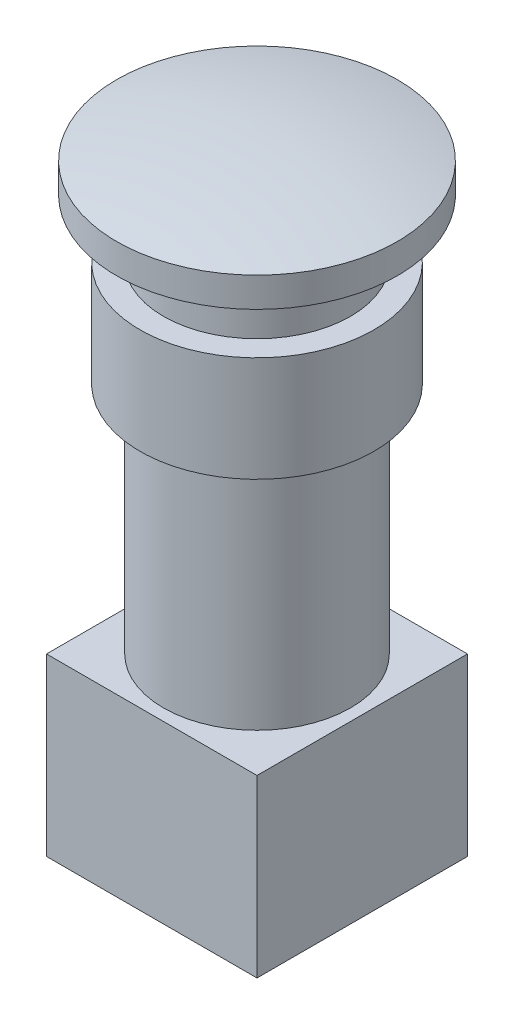
ISO-10303-21;
HEADER;
FILE_DESCRIPTION(('STEP AP214'),'2;1');
FILE_NAME('part.step','',(''),(''),'','','');
FILE_SCHEMA(('AUTOMOTIVE_DESIGN { 1 0 10303 214 1 1 1 1 }'));
ENDSEC;
DATA;
#1=APPLICATION_CONTEXT('core data for automotive mechanical design processes');
#2=APPLICATION_PROTOCOL_DEFINITION('international standard','automotive_design',2000,#1);
#3=PRODUCT_CONTEXT('',#1,'mechanical');
#4=PRODUCT('Part','Part','',(#3));
#5=PRODUCT_RELATED_PRODUCT_CATEGORY('part','',(#4));
#6=PRODUCT_DEFINITION_FORMATION('','',#4);
#7=PRODUCT_DEFINITION_CONTEXT('part definition',#1,'design');
#8=PRODUCT_DEFINITION('design','',#6,#7);
#9=PRODUCT_DEFINITION_SHAPE('','',#8);
#10=(LENGTH_UNIT() NAMED_UNIT(*) SI_UNIT(.MILLI.,.METRE.));
#11=(NAMED_UNIT(*) PLANE_ANGLE_UNIT() SI_UNIT($,.RADIAN.));
#12=(NAMED_UNIT(*) SI_UNIT($,.STERADIAN.) SOLID_ANGLE_UNIT());
#13=UNCERTAINTY_MEASURE_WITH_UNIT(LENGTH_MEASURE(1.E-05),#10,'distance_accuracy_value','');
#14=(GEOMETRIC_REPRESENTATION_CONTEXT(3) GLOBAL_UNCERTAINTY_ASSIGNED_CONTEXT((#13)) GLOBAL_UNIT_ASSIGNED_CONTEXT((#10,
#11,#12)) REPRESENTATION_CONTEXT('',''));
#15=CARTESIAN_POINT('',(0.,0.,0.));
#16=DIRECTION('',(0.,0.,1.));
#17=DIRECTION('',(1.,0.,0.));
#18=AXIS2_PLACEMENT_3D('',#15,#16,#17);
#19=CARTESIAN_POINT('',(0.,0.,0.));
#20=DIRECTION('',(0.,-1.,0.));
#21=DIRECTION('',(0.,0.,-1.));
#22=AXIS2_PLACEMENT_3D('',#19,#20,#21);
#23=CYLINDRICAL_SURFACE('',#22,8.);
#24=CARTESIAN_POINT('',(0.,0.,0.));
#25=DIRECTION('',(0.,-1.,0.));
#26=DIRECTION('',(0.,0.,-1.));
#27=AXIS2_PLACEMENT_3D('',#24,#25,#26);
#28=CIRCLE('',#27,8.);
#29=CARTESIAN_POINT('',(0.,0.,-8.));
#30=VERTEX_POINT('',#29);
#31=EDGE_CURVE('E11',#30,#30,#28,.T.);
#32=ORIENTED_EDGE('',*,*,#31,.F.);
#33=EDGE_LOOP('',(#32));
#34=FACE_BOUND('',#33,.T.);
#35=CARTESIAN_POINT('',(0.,20.,0.));
#36=DIRECTION('',(0.,-1.,0.));
#37=DIRECTION('',(0.,0.,-1.));
#38=AXIS2_PLACEMENT_3D('',#35,#36,#37);
#39=CIRCLE('',#38,8.);
#40=CARTESIAN_POINT('',(0.,20.,-8.));
#41=VERTEX_POINT('',#40);
#42=EDGE_CURVE('E44',#41,#41,#39,.T.);
#43=ORIENTED_EDGE('',*,*,#42,.T.);
#44=EDGE_LOOP('',(#43));
#45=FACE_BOUND('',#44,.T.);
#46=ADVANCED_FACE('F36',(#34,#45),#23,.T.);
#47=CARTESIAN_POINT('',(-10.,20.,0.));
#48=DIRECTION('',(0.,1.,0.));
#49=DIRECTION('',(0.,0.,1.));
#50=AXIS2_PLACEMENT_3D('',#47,#48,#49);
#51=PLANE('',#50);
#52=ORIENTED_EDGE('',*,*,#42,.F.);
#53=EDGE_LOOP('',(#52));
#54=FACE_BOUND('',#53,.T.);
#55=CARTESIAN_POINT('',(0.,20.,0.));
#56=DIRECTION('',(0.,-1.,0.));
#57=DIRECTION('',(0.,0.,-1.));
#58=AXIS2_PLACEMENT_3D('',#55,#56,#57);
#59=CIRCLE('',#58,10.);
#60=CARTESIAN_POINT('',(0.,20.,-10.));
#61=VERTEX_POINT('',#60);
#62=EDGE_CURVE('E127',#61,#61,#59,.T.);
#63=ORIENTED_EDGE('',*,*,#62,.T.);
#64=EDGE_LOOP('',(#63));
#65=FACE_BOUND('',#64,.T.);
#66=ADVANCED_FACE('F133',(#54,#65),#51,.F.);
#67=CARTESIAN_POINT('',(0.,0.,0.));
#68=DIRECTION('',(0.,-1.,0.));
#69=DIRECTION('',(0.,0.,-1.));
#70=AXIS2_PLACEMENT_3D('',#67,#68,#69);
#71=CYLINDRICAL_SURFACE('',#70,10.);
#72=ORIENTED_EDGE('',*,*,#62,.F.);
#73=EDGE_LOOP('',(#72));
#74=FACE_BOUND('',#73,.T.);
#75=CARTESIAN_POINT('',(0.,29.,0.));
#76=DIRECTION('',(0.,-1.,0.));
#77=DIRECTION('',(0.,0.,-1.));
#78=AXIS2_PLACEMENT_3D('',#75,#76,#77);
#79=CIRCLE('',#78,10.);
#80=CARTESIAN_POINT('',(0.,29.,-10.));
#81=VERTEX_POINT('',#80);
#82=EDGE_CURVE('E124',#81,#81,#79,.T.);
#83=ORIENTED_EDGE('',*,*,#82,.T.);
#84=EDGE_LOOP('',(#83));
#85=FACE_BOUND('',#84,.T.);
#86=ADVANCED_FACE('F136',(#74,#85),#71,.T.);
#87=CARTESIAN_POINT('',(-8.,29.,0.));
#88=DIRECTION('',(0.,-1.,0.));
#89=DIRECTION('',(0.,0.,-1.));
#90=AXIS2_PLACEMENT_3D('',#87,#88,#89);
#91=PLANE('',#90);
#92=ORIENTED_EDGE('',*,*,#82,.F.);
#93=EDGE_LOOP('',(#92));
#94=FACE_BOUND('',#93,.T.);
#95=CARTESIAN_POINT('',(0.,29.,0.));
#96=DIRECTION('',(0.,-1.,0.));
#97=DIRECTION('',(0.,0.,-1.));
#98=AXIS2_PLACEMENT_3D('',#95,#96,#97);
#99=CIRCLE('',#98,8.);
#100=CARTESIAN_POINT('',(0.,29.,-8.));
#101=VERTEX_POINT('',#100);
#102=EDGE_CURVE('E121',#101,#101,#99,.T.);
#103=ORIENTED_EDGE('',*,*,#102,.T.);
#104=EDGE_LOOP('',(#103));
#105=FACE_BOUND('',#104,.T.);
#106=ADVANCED_FACE('F141',(#94,#105),#91,.F.);
#107=CARTESIAN_POINT('',(0.,0.,0.));
#108=DIRECTION('',(0.,-1.,0.));
#109=DIRECTION('',(0.,0.,-1.));
#110=AXIS2_PLACEMENT_3D('',#107,#108,#109);
#111=CYLINDRICAL_SURFACE('',#110,8.);
#112=ORIENTED_EDGE('',*,*,#102,.F.);
#113=EDGE_LOOP('',(#112));
#114=FACE_BOUND('',#113,.T.);
#115=CARTESIAN_POINT('',(0.,34.,0.));
#116=DIRECTION('',(0.,-1.,0.));
#117=DIRECTION('',(0.,0.,-1.));
#118=AXIS2_PLACEMENT_3D('',#115,#116,#117);
#119=CIRCLE('',#118,8.);
#120=CARTESIAN_POINT('',(0.,34.,-8.));
#121=VERTEX_POINT('',#120);
#122=EDGE_CURVE('E118',#121,#121,#119,.T.);
#123=ORIENTED_EDGE('',*,*,#122,.T.);
#124=EDGE_LOOP('',(#123));
#125=FACE_BOUND('',#124,.T.);
#126=ADVANCED_FACE('F147',(#114,#125),#111,.T.);
#127=CARTESIAN_POINT('',(-12.,34.,0.));
#128=DIRECTION('',(0.,1.,0.));
#129=DIRECTION('',(0.,0.,1.));
#130=AXIS2_PLACEMENT_3D('',#127,#128,#129);
#131=PLANE('',#130);
#132=ORIENTED_EDGE('',*,*,#122,.F.);
#133=EDGE_LOOP('',(#132));
#134=FACE_BOUND('',#133,.T.);
#135=CARTESIAN_POINT('',(0.,34.,0.));
#136=DIRECTION('',(0.,-1.,0.));
#137=DIRECTION('',(0.,0.,-1.));
#138=AXIS2_PLACEMENT_3D('',#135,#136,#137);
#139=CIRCLE('',#138,12.);
#140=CARTESIAN_POINT('',(0.,34.,-12.));
#141=VERTEX_POINT('',#140);
#142=EDGE_CURVE('E115',#141,#141,#139,.T.);
#143=ORIENTED_EDGE('',*,*,#142,.T.);
#144=EDGE_LOOP('',(#143));
#145=FACE_BOUND('',#144,.T.);
#146=ADVANCED_FACE('F153',(#134,#145),#131,.F.);
#147=CARTESIAN_POINT('',(0.,0.,0.));
#148=DIRECTION('',(0.,-1.,0.));
#149=DIRECTION('',(0.,0.,-1.));
#150=AXIS2_PLACEMENT_3D('',#147,#148,#149);
#151=CYLINDRICAL_SURFACE('',#150,12.);
#152=ORIENTED_EDGE('',*,*,#142,.F.);
#153=EDGE_LOOP('',(#152));
#154=FACE_BOUND('',#153,.T.);
#155=CARTESIAN_POINT('',(0.,36.5386443980464,0.));
#156=DIRECTION('',(0.,-1.,0.));
#157=DIRECTION('',(0.,0.,-1.));
#158=AXIS2_PLACEMENT_3D('',#155,#156,#157);
#159=CIRCLE('',#158,12.);
#160=CARTESIAN_POINT('',(0.,36.5386443980464,-12.));
#161=VERTEX_POINT('',#160);
#162=EDGE_CURVE('E112',#161,#161,#159,.T.);
#163=ORIENTED_EDGE('',*,*,#162,.T.);
#164=EDGE_LOOP('',(#163));
#165=FACE_BOUND('',#164,.T.);
#166=ADVANCED_FACE('F159',(#154,#165),#151,.T.);
#167=CARTESIAN_POINT('',(0.,-12.,0.));
#168=DIRECTION('',(0.,-1.,0.));
#169=DIRECTION('',(-1.,0.,0.));
#170=AXIS2_PLACEMENT_3D('',#167,#168,#169);
#171=SPHERICAL_SURFACE('',#170,50.);
#172=ORIENTED_EDGE('',*,*,#162,.F.);
#173=EDGE_LOOP('',(#172));
#174=FACE_BOUND('',#173,.T.);
#175=ADVANCED_FACE('F165',(#174),#171,.T.);
#176=CARTESIAN_POINT('',(-9.,0.,-9.));
#177=DIRECTION('',(0.,-1.,0.));
#178=DIRECTION('',(0.,0.,-1.));
#179=AXIS2_PLACEMENT_3D('',#176,#177,#178);
#180=PLANE('',#179);
#181=DIRECTION('',(0.,0.,-1.));
#182=VECTOR('',#181,1.);
#183=CARTESIAN_POINT('',(-9.,0.,9.));
#184=LINE('',#183,#182);
#185=CARTESIAN_POINT('',(-9.,0.,9.));
#186=VERTEX_POINT('',#185);
#187=CARTESIAN_POINT('',(-9.,0.,-9.));
#188=VERTEX_POINT('',#187);
#189=EDGE_CURVE('E103',#186,#188,#184,.T.);
#190=ORIENTED_EDGE('',*,*,#189,.F.);
#191=DIRECTION('',(-1.,0.,0.));
#192=VECTOR('',#191,1.);
#193=CARTESIAN_POINT('',(-9.,0.,9.));
#194=LINE('',#193,#192);
#195=CARTESIAN_POINT('',(9.,0.,9.));
#196=VERTEX_POINT('',#195);
#197=EDGE_CURVE('E75',#196,#186,#194,.T.);
#198=ORIENTED_EDGE('',*,*,#197,.F.);
#199=DIRECTION('',(0.,0.,1.));
#200=VECTOR('',#199,1.);
#201=CARTESIAN_POINT('',(9.,0.,9.));
#202=LINE('',#201,#200);
#203=CARTESIAN_POINT('',(9.,0.,-9.));
#204=VERTEX_POINT('',#203);
#205=EDGE_CURVE('E69',#204,#196,#202,.T.);
#206=ORIENTED_EDGE('',*,*,#205,.F.);
#207=DIRECTION('',(1.,0.,0.));
#208=VECTOR('',#207,1.);
#209=CARTESIAN_POINT('',(-9.,0.,-9.));
#210=LINE('',#209,#208);
#211=EDGE_CURVE('E93',#188,#204,#210,.T.);
#212=ORIENTED_EDGE('',*,*,#211,.F.);
#213=EDGE_LOOP('',(#190,#198,#206,#212));
#214=FACE_BOUND('',#213,.T.);
#215=ORIENTED_EDGE('',*,*,#31,.T.);
#216=EDGE_LOOP('',(#215));
#217=FACE_BOUND('',#216,.T.);
#218=ADVANCED_FACE('F170',(#214,#217),#180,.F.);
#219=CARTESIAN_POINT('',(-9.,-15.,9.));
#220=DIRECTION('',(1.,0.,0.));
#221=DIRECTION('',(0.,0.,-1.));
#222=AXIS2_PLACEMENT_3D('',#219,#220,#221);
#223=PLANE('',#222);
#224=ORIENTED_EDGE('',*,*,#189,.T.);
#225=DIRECTION('',(0.,1.,0.));
#226=VECTOR('',#225,1.);
#227=CARTESIAN_POINT('',(-9.,-15.,-9.));
#228=LINE('',#227,#226);
#229=CARTESIAN_POINT('',(-9.,-15.,-9.));
#230=VERTEX_POINT('',#229);
#231=EDGE_CURVE('E94',#230,#188,#228,.T.);
#232=ORIENTED_EDGE('',*,*,#231,.F.);
#233=DIRECTION('',(0.,0.,-1.));
#234=VECTOR('',#233,1.);
#235=CARTESIAN_POINT('',(-9.,-15.,9.));
#236=LINE('',#235,#234);
#237=CARTESIAN_POINT('',(-9.,-15.,9.));
#238=VERTEX_POINT('',#237);
#239=EDGE_CURVE('E88',#238,#230,#236,.T.);
#240=ORIENTED_EDGE('',*,*,#239,.F.);
#241=DIRECTION('',(0.,1.,0.));
#242=VECTOR('',#241,1.);
#243=CARTESIAN_POINT('',(-9.,-15.,9.));
#244=LINE('',#243,#242);
#245=EDGE_CURVE('E99',#238,#186,#244,.T.);
#246=ORIENTED_EDGE('',*,*,#245,.T.);
#247=EDGE_LOOP('',(#224,#232,#240,#246));
#248=FACE_BOUND('',#247,.T.);
#249=ADVANCED_FACE('F175',(#248),#223,.F.);
#250=CARTESIAN_POINT('',(-9.,-15.,-9.));
#251=DIRECTION('',(0.,0.,1.));
#252=DIRECTION('',(1.,0.,0.));
#253=AXIS2_PLACEMENT_3D('',#250,#251,#252);
#254=PLANE('',#253);
#255=ORIENTED_EDGE('',*,*,#211,.T.);
#256=DIRECTION('',(0.,1.,0.));
#257=VECTOR('',#256,1.);
#258=CARTESIAN_POINT('',(9.,-15.,-9.));
#259=LINE('',#258,#257);
#260=CARTESIAN_POINT('',(9.,-15.,-9.));
#261=VERTEX_POINT('',#260);
#262=EDGE_CURVE('E91',#261,#204,#259,.T.);
#263=ORIENTED_EDGE('',*,*,#262,.F.);
#264=DIRECTION('',(1.,0.,0.));
#265=VECTOR('',#264,1.);
#266=CARTESIAN_POINT('',(-9.,-15.,-9.));
#267=LINE('',#266,#265);
#268=EDGE_CURVE('E83',#230,#261,#267,.T.);
#269=ORIENTED_EDGE('',*,*,#268,.F.);
#270=ORIENTED_EDGE('',*,*,#231,.T.);
#271=EDGE_LOOP('',(#255,#263,#269,#270));
#272=FACE_BOUND('',#271,.T.);
#273=ADVANCED_FACE('F92',(#272),#254,.F.);
#274=CARTESIAN_POINT('',(9.,-15.,9.));
#275=DIRECTION('',(-1.,0.,0.));
#276=DIRECTION('',(0.,0.,1.));
#277=AXIS2_PLACEMENT_3D('',#274,#275,#276);
#278=PLANE('',#277);
#279=ORIENTED_EDGE('',*,*,#205,.T.);
#280=DIRECTION('',(0.,1.,0.));
#281=VECTOR('',#280,1.);
#282=CARTESIAN_POINT('',(9.,-15.,9.));
#283=LINE('',#282,#281);
#284=CARTESIAN_POINT('',(9.,-15.,9.));
#285=VERTEX_POINT('',#284);
#286=EDGE_CURVE('E95',#285,#196,#283,.T.);
#287=ORIENTED_EDGE('',*,*,#286,.F.);
#288=DIRECTION('',(0.,0.,1.));
#289=VECTOR('',#288,1.);
#290=CARTESIAN_POINT('',(9.,-15.,9.));
#291=LINE('',#290,#289);
#292=EDGE_CURVE('E86',#261,#285,#291,.T.);
#293=ORIENTED_EDGE('',*,*,#292,.F.);
#294=ORIENTED_EDGE('',*,*,#262,.T.);
#295=EDGE_LOOP('',(#279,#287,#293,#294));
#296=FACE_BOUND('',#295,.T.);
#297=ADVANCED_FACE('F97',(#296),#278,.F.);
#298=CARTESIAN_POINT('',(-9.,-15.,9.));
#299=DIRECTION('',(0.,0.,-1.));
#300=DIRECTION('',(-1.,0.,0.));
#301=AXIS2_PLACEMENT_3D('',#298,#299,#300);
#302=PLANE('',#301);
#303=ORIENTED_EDGE('',*,*,#197,.T.);
#304=ORIENTED_EDGE('',*,*,#245,.F.);
#305=DIRECTION('',(-1.,0.,0.));
#306=VECTOR('',#305,1.);
#307=CARTESIAN_POINT('',(-9.,-15.,9.));
#308=LINE('',#307,#306);
#309=EDGE_CURVE('E52',#285,#238,#308,.T.);
#310=ORIENTED_EDGE('',*,*,#309,.F.);
#311=ORIENTED_EDGE('',*,*,#286,.T.);
#312=EDGE_LOOP('',(#303,#304,#310,#311));
#313=FACE_BOUND('',#312,.T.);
#314=ADVANCED_FACE('F283',(#313),#302,.F.);
#315=CARTESIAN_POINT('',(-9.,-15.,-9.));
#316=DIRECTION('',(0.,-1.,0.));
#317=DIRECTION('',(0.,0.,-1.));
#318=AXIS2_PLACEMENT_3D('',#315,#316,#317);
#319=PLANE('',#318);
#320=ORIENTED_EDGE('',*,*,#239,.T.);
#321=ORIENTED_EDGE('',*,*,#268,.T.);
#322=ORIENTED_EDGE('',*,*,#292,.T.);
#323=ORIENTED_EDGE('',*,*,#309,.T.);
#324=EDGE_LOOP('',(#320,#321,#322,#323));
#325=FACE_BOUND('',#324,.T.);
#326=ADVANCED_FACE('F84',(#325),#319,.T.);
#327=CLOSED_SHELL('',(#46,#66,#86,#106,#126,#146,#166,#175,#218,#249,#273,#297,#314,#326));
#328=MANIFOLD_SOLID_BREP('B2',#327);
#329=ADVANCED_BREP_SHAPE_REPRESENTATION('',(#18,#328),#14);
#330=SHAPE_DEFINITION_REPRESENTATION(#9,#329);
ENDSEC;
END-ISO-10303-21;
